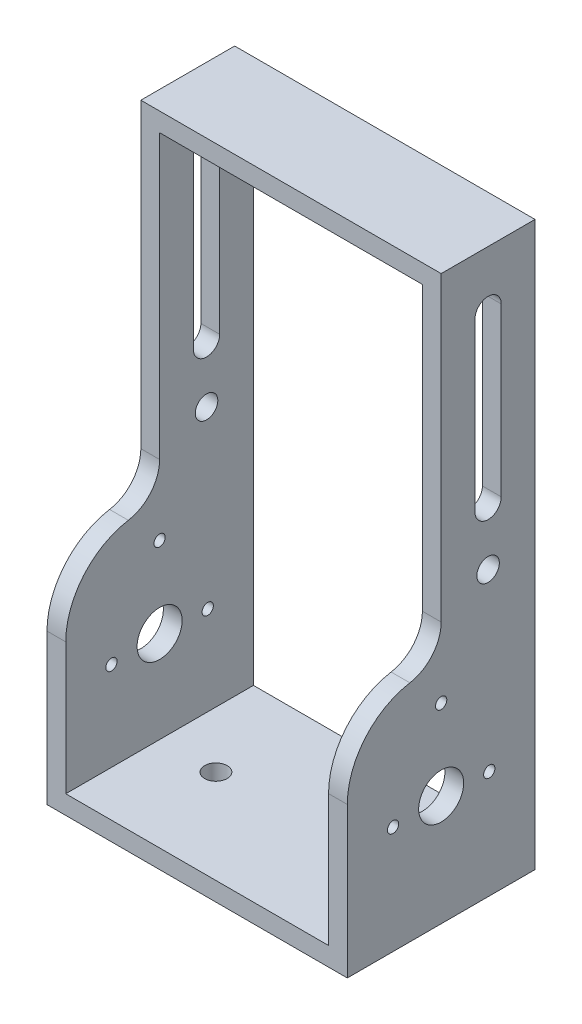
ISO-10303-21;
HEADER;
FILE_DESCRIPTION(('STEP AP214'),'2;1');
FILE_NAME('part.step','',(''),(''),'','','');
FILE_SCHEMA(('AUTOMOTIVE_DESIGN { 1 0 10303 214 1 1 1 1 }'));
ENDSEC;
DATA;
#1=APPLICATION_CONTEXT('core data for automotive mechanical design processes');
#2=APPLICATION_PROTOCOL_DEFINITION('international standard','automotive_design',2000,#1);
#3=PRODUCT_CONTEXT('',#1,'mechanical');
#4=PRODUCT('Part','Part','',(#3));
#5=PRODUCT_RELATED_PRODUCT_CATEGORY('part','',(#4));
#6=PRODUCT_DEFINITION_FORMATION('','',#4);
#7=PRODUCT_DEFINITION_CONTEXT('part definition',#1,'design');
#8=PRODUCT_DEFINITION('design','',#6,#7);
#9=PRODUCT_DEFINITION_SHAPE('','',#8);
#10=(LENGTH_UNIT() NAMED_UNIT(*) SI_UNIT(.MILLI.,.METRE.));
#11=(NAMED_UNIT(*) PLANE_ANGLE_UNIT() SI_UNIT($,.RADIAN.));
#12=(NAMED_UNIT(*) SI_UNIT($,.STERADIAN.) SOLID_ANGLE_UNIT());
#13=UNCERTAINTY_MEASURE_WITH_UNIT(LENGTH_MEASURE(1.E-05),#10,'distance_accuracy_value','');
#14=(GEOMETRIC_REPRESENTATION_CONTEXT(3) GLOBAL_UNCERTAINTY_ASSIGNED_CONTEXT((#13)) GLOBAL_UNIT_ASSIGNED_CONTEXT((#10,
#11,#12)) REPRESENTATION_CONTEXT('',''));
#15=CARTESIAN_POINT('',(0.,0.,0.));
#16=DIRECTION('',(0.,0.,1.));
#17=DIRECTION('',(1.,0.,0.));
#18=AXIS2_PLACEMENT_3D('',#15,#16,#17);
#19=CARTESIAN_POINT('',(0.,0.,25.));
#20=DIRECTION('',(0.,0.,1.));
#21=DIRECTION('',(1.,0.,0.));
#22=AXIS2_PLACEMENT_3D('',#19,#20,#21);
#23=PLANE('',#22);
#24=DIRECTION('',(0.,-1.,0.));
#25=VECTOR('',#24,1.);
#26=CARTESIAN_POINT('',(-35.,70.,25.));
#27=LINE('',#26,#25);
#28=CARTESIAN_POINT('',(-35.,-34.9647322536298,25.));
#29=VERTEX_POINT('',#28);
#30=CARTESIAN_POINT('',(-35.,-70.,25.));
#31=VERTEX_POINT('',#30);
#32=EDGE_CURVE('E281',#29,#31,#27,.T.);
#33=ORIENTED_EDGE('',*,*,#32,.F.);
#34=DIRECTION('',(-1.,0.,0.));
#35=VECTOR('',#34,1.);
#36=CARTESIAN_POINT('',(-40.,-34.9647322536298,25.));
#37=LINE('',#36,#35);
#38=CARTESIAN_POINT('',(-40.,-34.9647322536298,25.));
#39=VERTEX_POINT('',#38);
#40=EDGE_CURVE('E345',#29,#39,#37,.T.);
#41=ORIENTED_EDGE('',*,*,#40,.T.);
#42=DIRECTION('',(0.,-1.,0.));
#43=VECTOR('',#42,1.);
#44=CARTESIAN_POINT('',(-40.,70.,25.));
#45=LINE('',#44,#43);
#46=CARTESIAN_POINT('',(-40.,-75.,25.));
#47=VERTEX_POINT('',#46);
#48=EDGE_CURVE('E310',#39,#47,#45,.T.);
#49=ORIENTED_EDGE('',*,*,#48,.T.);
#50=DIRECTION('',(1.,0.,0.));
#51=VECTOR('',#50,1.);
#52=CARTESIAN_POINT('',(-35.,-75.,25.));
#53=LINE('',#52,#51);
#54=CARTESIAN_POINT('',(40.,-75.,25.));
#55=VERTEX_POINT('',#54);
#56=EDGE_CURVE('E313',#47,#55,#53,.T.);
#57=ORIENTED_EDGE('',*,*,#56,.T.);
#58=DIRECTION('',(0.,1.,0.));
#59=VECTOR('',#58,1.);
#60=CARTESIAN_POINT('',(40.,70.,25.));
#61=LINE('',#60,#59);
#62=CARTESIAN_POINT('',(40.,-34.9647322536298,25.));
#63=VERTEX_POINT('',#62);
#64=EDGE_CURVE('E307',#55,#63,#61,.T.);
#65=ORIENTED_EDGE('',*,*,#64,.T.);
#66=DIRECTION('',(-1.,0.,0.));
#67=VECTOR('',#66,1.);
#68=CARTESIAN_POINT('',(34.9999999999999,-34.9647322536298,25.));
#69=LINE('',#68,#67);
#70=CARTESIAN_POINT('',(35.,-34.9647322536298,25.));
#71=VERTEX_POINT('',#70);
#72=EDGE_CURVE('E343',#63,#71,#69,.T.);
#73=ORIENTED_EDGE('',*,*,#72,.T.);
#74=DIRECTION('',(0.,1.,0.));
#75=VECTOR('',#74,1.);
#76=CARTESIAN_POINT('',(35.,70.,25.));
#77=LINE('',#76,#75);
#78=CARTESIAN_POINT('',(35.,-70.,25.));
#79=VERTEX_POINT('',#78);
#80=EDGE_CURVE('E278',#79,#71,#77,.T.);
#81=ORIENTED_EDGE('',*,*,#80,.F.);
#82=DIRECTION('',(1.,0.,0.));
#83=VECTOR('',#82,1.);
#84=CARTESIAN_POINT('',(-35.,-70.,25.));
#85=LINE('',#84,#83);
#86=EDGE_CURVE('E284',#31,#79,#85,.T.);
#87=ORIENTED_EDGE('',*,*,#86,.F.);
#88=EDGE_LOOP('',(#33,#41,#49,#57,#65,#73,#81,#87));
#89=FACE_BOUND('',#88,.T.);
#90=ADVANCED_FACE('F57',(#89),#23,.T.);
#91=CARTESIAN_POINT('',(0.,0.,-25.));
#92=DIRECTION('',(0.,0.,1.));
#93=DIRECTION('',(1.,0.,0.));
#94=AXIS2_PLACEMENT_3D('',#91,#92,#93);
#95=PLANE('',#94);
#96=DIRECTION('',(0.,1.,0.));
#97=VECTOR('',#96,1.);
#98=CARTESIAN_POINT('',(40.,70.,-25.));
#99=LINE('',#98,#97);
#100=CARTESIAN_POINT('',(40.,-75.,-25.));
#101=VERTEX_POINT('',#100);
#102=CARTESIAN_POINT('',(40.,75.,-25.));
#103=VERTEX_POINT('',#102);
#104=EDGE_CURVE('E306',#101,#103,#99,.T.);
#105=ORIENTED_EDGE('',*,*,#104,.F.);
#106=DIRECTION('',(1.,0.,0.));
#107=VECTOR('',#106,1.);
#108=CARTESIAN_POINT('',(-35.,-75.,-25.));
#109=LINE('',#108,#107);
#110=CARTESIAN_POINT('',(-40.,-75.,-25.));
#111=VERTEX_POINT('',#110);
#112=EDGE_CURVE('E311',#111,#101,#109,.T.);
#113=ORIENTED_EDGE('',*,*,#112,.F.);
#114=DIRECTION('',(0.,-1.,0.));
#115=VECTOR('',#114,1.);
#116=CARTESIAN_POINT('',(-40.,70.,-25.));
#117=LINE('',#116,#115);
#118=CARTESIAN_POINT('',(-40.,75.,-25.));
#119=VERTEX_POINT('',#118);
#120=EDGE_CURVE('E321',#119,#111,#117,.T.);
#121=ORIENTED_EDGE('',*,*,#120,.F.);
#122=DIRECTION('',(-1.,0.,0.));
#123=VECTOR('',#122,1.);
#124=CARTESIAN_POINT('',(-35.,75.,-25.));
#125=LINE('',#124,#123);
#126=EDGE_CURVE('E318',#103,#119,#125,.T.);
#127=ORIENTED_EDGE('',*,*,#126,.F.);
#128=EDGE_LOOP('',(#105,#113,#121,#127));
#129=FACE_BOUND('',#128,.T.);
#130=DIRECTION('',(0.,1.,0.));
#131=VECTOR('',#130,1.);
#132=CARTESIAN_POINT('',(35.,70.,-25.));
#133=LINE('',#132,#131);
#134=CARTESIAN_POINT('',(35.,-70.,-25.));
#135=VERTEX_POINT('',#134);
#136=CARTESIAN_POINT('',(35.,70.,-25.));
#137=VERTEX_POINT('',#136);
#138=EDGE_CURVE('E287',#135,#137,#133,.T.);
#139=ORIENTED_EDGE('',*,*,#138,.T.);
#140=DIRECTION('',(-1.,0.,0.));
#141=VECTOR('',#140,1.);
#142=CARTESIAN_POINT('',(-35.,70.,-25.));
#143=LINE('',#142,#141);
#144=CARTESIAN_POINT('',(-35.,70.,-25.));
#145=VERTEX_POINT('',#144);
#146=EDGE_CURVE('E290',#137,#145,#143,.T.);
#147=ORIENTED_EDGE('',*,*,#146,.T.);
#148=DIRECTION('',(0.,-1.,0.));
#149=VECTOR('',#148,1.);
#150=CARTESIAN_POINT('',(-35.,70.,-25.));
#151=LINE('',#150,#149);
#152=CARTESIAN_POINT('',(-35.,-70.,-25.));
#153=VERTEX_POINT('',#152);
#154=EDGE_CURVE('E293',#145,#153,#151,.T.);
#155=ORIENTED_EDGE('',*,*,#154,.T.);
#156=DIRECTION('',(1.,0.,0.));
#157=VECTOR('',#156,1.);
#158=CARTESIAN_POINT('',(-35.,-70.,-25.));
#159=LINE('',#158,#157);
#160=EDGE_CURVE('E282',#153,#135,#159,.T.);
#161=ORIENTED_EDGE('',*,*,#160,.T.);
#162=EDGE_LOOP('',(#139,#147,#155,#161));
#163=FACE_BOUND('',#162,.T.);
#164=ADVANCED_FACE('F469',(#129,#163),#95,.F.);
#165=CARTESIAN_POINT('',(40.,70.,25.));
#166=DIRECTION('',(-1.,0.,0.));
#167=DIRECTION('',(0.,-1.,0.));
#168=AXIS2_PLACEMENT_3D('',#165,#166,#167);
#169=PLANE('',#168);
#170=DIRECTION('',(0.,-1.,0.));
#171=VECTOR('',#170,1.);
#172=CARTESIAN_POINT('',(40.,60.,-9.00000000000001));
#173=LINE('',#172,#171);
#174=CARTESIAN_POINT('',(40.,60.,-9.00000000000001));
#175=VERTEX_POINT('',#174);
#176=CARTESIAN_POINT('',(40.,15.5,-9.00000000000001));
#177=VERTEX_POINT('',#176);
#178=EDGE_CURVE('E238',#175,#177,#173,.T.);
#179=ORIENTED_EDGE('',*,*,#178,.F.);
#180=CARTESIAN_POINT('',(40.,60.,-12.5));
#181=DIRECTION('',(1.,0.,0.));
#182=DIRECTION('',(0.,1.,0.));
#183=AXIS2_PLACEMENT_3D('',#180,#181,#182);
#184=CIRCLE('',#183,3.5);
#185=CARTESIAN_POINT('',(40.,60.,-16.));
#186=VERTEX_POINT('',#185);
#187=EDGE_CURVE('E61',#186,#175,#184,.T.);
#188=ORIENTED_EDGE('',*,*,#187,.F.);
#189=DIRECTION('',(0.,1.,0.));
#190=VECTOR('',#189,1.);
#191=CARTESIAN_POINT('',(40.,60.,-16.));
#192=LINE('',#191,#190);
#193=CARTESIAN_POINT('',(40.,15.5,-16.));
#194=VERTEX_POINT('',#193);
#195=EDGE_CURVE('E106',#194,#186,#192,.T.);
#196=ORIENTED_EDGE('',*,*,#195,.F.);
#197=CARTESIAN_POINT('',(40.,15.5,-12.5));
#198=DIRECTION('',(1.,0.,0.));
#199=DIRECTION('',(0.,1.,0.));
#200=AXIS2_PLACEMENT_3D('',#197,#198,#199);
#201=CIRCLE('',#200,3.5);
#202=EDGE_CURVE('E242',#177,#194,#201,.T.);
#203=ORIENTED_EDGE('',*,*,#202,.F.);
#204=EDGE_LOOP('',(#179,#188,#196,#203));
#205=FACE_BOUND('',#204,.T.);
#206=CARTESIAN_POINT('',(40.,-46.2711686117605,-12.8178141423564));
#207=DIRECTION('',(-1.,0.,0.));
#208=DIRECTION('',(0.,-1.,0.));
#209=AXIS2_PLACEMENT_3D('',#206,#207,#208);
#210=CIRCLE('',#209,1.49999999999999);
#211=CARTESIAN_POINT('',(40.,-47.7711686117605,-12.8178141423564));
#212=VERTEX_POINT('',#211);
#213=EDGE_CURVE('E388',#212,#212,#210,.T.);
#214=ORIENTED_EDGE('',*,*,#213,.T.);
#215=EDGE_LOOP('',(#214));
#216=FACE_BOUND('',#215,.T.);
#217=CARTESIAN_POINT('',(40.,0.499999999999999,-12.5));
#218=DIRECTION('',(-1.,0.,0.));
#219=DIRECTION('',(0.,-1.,0.));
#220=AXIS2_PLACEMENT_3D('',#217,#218,#219);
#221=CIRCLE('',#220,3.);
#222=CARTESIAN_POINT('',(40.,-2.5,-12.5));
#223=VERTEX_POINT('',#222);
#224=EDGE_CURVE('E373',#223,#223,#221,.T.);
#225=ORIENTED_EDGE('',*,*,#224,.T.);
#226=EDGE_LOOP('',(#225));
#227=FACE_BOUND('',#226,.T.);
#228=CARTESIAN_POINT('',(40.,-45.5237993555332,0.));
#229=DIRECTION('',(-1.,0.,0.));
#230=DIRECTION('',(0.,-1.,0.));
#231=AXIS2_PLACEMENT_3D('',#228,#229,#230);
#232=CIRCLE('',#231,6.);
#233=CARTESIAN_POINT('',(40.,-51.5237993555332,0.));
#234=VERTEX_POINT('',#233);
#235=EDGE_CURVE('E369',#234,#234,#232,.T.);
#236=ORIENTED_EDGE('',*,*,#235,.T.);
#237=EDGE_LOOP('',(#236));
#238=FACE_BOUND('',#237,.T.);
#239=CARTESIAN_POINT('',(40.,-46.2711686117605,12.8178141423564));
#240=DIRECTION('',(-1.,0.,0.));
#241=DIRECTION('',(0.,-1.,0.));
#242=AXIS2_PLACEMENT_3D('',#239,#240,#241);
#243=CIRCLE('',#242,1.49999999999992);
#244=CARTESIAN_POINT('',(40.,-47.7711686117604,12.8178141423564));
#245=VERTEX_POINT('',#244);
#246=EDGE_CURVE('E365',#245,#245,#243,.T.);
#247=ORIENTED_EDGE('',*,*,#246,.T.);
#248=EDGE_LOOP('',(#247));
#249=FACE_BOUND('',#248,.T.);
#250=CARTESIAN_POINT('',(40.,-24.0700632752243,0.));
#251=DIRECTION('',(-1.,0.,0.));
#252=DIRECTION('',(0.,-1.,0.));
#253=AXIS2_PLACEMENT_3D('',#250,#251,#252);
#254=CIRCLE('',#253,1.5);
#255=CARTESIAN_POINT('',(40.,-25.5700632752243,0.));
#256=VERTEX_POINT('',#255);
#257=EDGE_CURVE('E361',#256,#256,#254,.T.);
#258=ORIENTED_EDGE('',*,*,#257,.T.);
#259=EDGE_LOOP('',(#258));
#260=FACE_BOUND('',#259,.T.);
#261=CARTESIAN_POINT('',(40.,-5.38433333813169,10.));
#262=DIRECTION('',(1.,0.,0.));
#263=DIRECTION('',(0.,1.,0.));
#264=AXIS2_PLACEMENT_3D('',#261,#262,#263);
#265=CIRCLE('',#264,10.);
#266=CARTESIAN_POINT('',(40.,-15.2444663099644,8.33333333333333));
#267=VERTEX_POINT('',#266);
#268=CARTESIAN_POINT('',(40.,-5.38433333813165,0.));
#269=VERTEX_POINT('',#268);
#270=EDGE_CURVE('E277',#267,#269,#265,.T.);
#271=ORIENTED_EDGE('',*,*,#270,.F.);
#272=CARTESIAN_POINT('',(40.,-34.9647322536298,5.));
#273=DIRECTION('',(-1.,0.,0.));
#274=DIRECTION('',(0.,-1.,0.));
#275=AXIS2_PLACEMENT_3D('',#272,#273,#274);
#276=CIRCLE('',#275,20.);
#277=EDGE_CURVE('E231',#267,#63,#276,.F.);
#278=ORIENTED_EDGE('',*,*,#277,.T.);
#279=ORIENTED_EDGE('',*,*,#64,.F.);
#280=DIRECTION('',(0.,0.,-1.));
#281=VECTOR('',#280,1.);
#282=CARTESIAN_POINT('',(40.,-75.,25.));
#283=LINE('',#282,#281);
#284=EDGE_CURVE('E315',#55,#101,#283,.T.);
#285=ORIENTED_EDGE('',*,*,#284,.T.);
#286=ORIENTED_EDGE('',*,*,#104,.T.);
#287=DIRECTION('',(0.,0.,-1.));
#288=VECTOR('',#287,1.);
#289=CARTESIAN_POINT('',(40.,75.,25.));
#290=LINE('',#289,#288);
#291=CARTESIAN_POINT('',(40.,75.,0.));
#292=VERTEX_POINT('',#291);
#293=EDGE_CURVE('E331',#292,#103,#290,.T.);
#294=ORIENTED_EDGE('',*,*,#293,.F.);
#295=DIRECTION('',(0.,-1.,0.));
#296=VECTOR('',#295,1.);
#297=CARTESIAN_POINT('',(40.,70.,0.));
#298=LINE('',#297,#296);
#299=EDGE_CURVE('E271',#292,#269,#298,.T.);
#300=ORIENTED_EDGE('',*,*,#299,.T.);
#301=EDGE_LOOP('',(#271,#278,#279,#285,#286,#294,#300));
#302=FACE_BOUND('',#301,.T.);
#303=ADVANCED_FACE('F444',(#205,#216,#227,#238,#249,#260,#302),#169,.F.);
#304=CARTESIAN_POINT('',(-35.,75.,25.));
#305=DIRECTION('',(0.,-1.,0.));
#306=DIRECTION('',(0.,0.,-1.));
#307=AXIS2_PLACEMENT_3D('',#304,#305,#306);
#308=PLANE('',#307);
#309=DIRECTION('',(0.,0.,-1.));
#310=VECTOR('',#309,1.);
#311=CARTESIAN_POINT('',(-40.,75.,25.));
#312=LINE('',#311,#310);
#313=CARTESIAN_POINT('',(-40.,75.,0.));
#314=VERTEX_POINT('',#313);
#315=EDGE_CURVE('E329',#314,#119,#312,.T.);
#316=ORIENTED_EDGE('',*,*,#315,.F.);
#317=DIRECTION('',(1.,0.,0.));
#318=VECTOR('',#317,1.);
#319=CARTESIAN_POINT('',(-40.,75.,0.));
#320=LINE('',#319,#318);
#321=EDGE_CURVE('E258',#314,#292,#320,.T.);
#322=ORIENTED_EDGE('',*,*,#321,.T.);
#323=ORIENTED_EDGE('',*,*,#293,.T.);
#324=ORIENTED_EDGE('',*,*,#126,.T.);
#325=EDGE_LOOP('',(#316,#322,#323,#324));
#326=FACE_BOUND('',#325,.T.);
#327=ADVANCED_FACE('F488',(#326),#308,.F.);
#328=CARTESIAN_POINT('',(-40.,70.,25.));
#329=DIRECTION('',(1.,0.,0.));
#330=DIRECTION('',(0.,1.,0.));
#331=AXIS2_PLACEMENT_3D('',#328,#329,#330);
#332=PLANE('',#331);
#333=DIRECTION('',(0.,1.,0.));
#334=VECTOR('',#333,1.);
#335=CARTESIAN_POINT('',(-40.0000000000001,60.,-16.));
#336=LINE('',#335,#334);
#337=CARTESIAN_POINT('',(-40.0000000000001,15.5,-16.));
#338=VERTEX_POINT('',#337);
#339=CARTESIAN_POINT('',(-40.0000000000001,60.,-16.));
#340=VERTEX_POINT('',#339);
#341=EDGE_CURVE('E402',#338,#340,#336,.T.);
#342=ORIENTED_EDGE('',*,*,#341,.T.);
#343=CARTESIAN_POINT('',(-40.0000000000001,60.,-12.5));
#344=DIRECTION('',(1.,0.,0.));
#345=DIRECTION('',(0.,1.,0.));
#346=AXIS2_PLACEMENT_3D('',#343,#344,#345);
#347=CIRCLE('',#346,3.5);
#348=CARTESIAN_POINT('',(-40.0000000000001,60.,-9.00000000000001));
#349=VERTEX_POINT('',#348);
#350=EDGE_CURVE('E433',#340,#349,#347,.T.);
#351=ORIENTED_EDGE('',*,*,#350,.T.);
#352=DIRECTION('',(0.,-1.,0.));
#353=VECTOR('',#352,1.);
#354=CARTESIAN_POINT('',(-40.0000000000001,60.,-9.00000000000001));
#355=LINE('',#354,#353);
#356=CARTESIAN_POINT('',(-40.,15.5,-9.00000000000001));
#357=VERTEX_POINT('',#356);
#358=EDGE_CURVE('E210',#349,#357,#355,.T.);
#359=ORIENTED_EDGE('',*,*,#358,.T.);
#360=CARTESIAN_POINT('',(-40.0000000000001,15.5,-12.5));
#361=DIRECTION('',(1.,0.,0.));
#362=DIRECTION('',(0.,1.,0.));
#363=AXIS2_PLACEMENT_3D('',#360,#361,#362);
#364=CIRCLE('',#363,3.5);
#365=EDGE_CURVE('E83',#357,#338,#364,.T.);
#366=ORIENTED_EDGE('',*,*,#365,.T.);
#367=EDGE_LOOP('',(#342,#351,#359,#366));
#368=FACE_BOUND('',#367,.T.);
#369=CARTESIAN_POINT('',(-40.0000000000001,-46.2711686117605,-12.8178141423564));
#370=DIRECTION('',(1.,0.,0.));
#371=DIRECTION('',(0.,1.,0.));
#372=AXIS2_PLACEMENT_3D('',#369,#370,#371);
#373=CIRCLE('',#372,1.49999999999999);
#374=CARTESIAN_POINT('',(-40.0000000000001,-44.7711686117605,-12.8178141423564));
#375=VERTEX_POINT('',#374);
#376=EDGE_CURVE('E419',#375,#375,#373,.T.);
#377=ORIENTED_EDGE('',*,*,#376,.T.);
#378=EDGE_LOOP('',(#377));
#379=FACE_BOUND('',#378,.T.);
#380=CARTESIAN_POINT('',(-40.0000000000001,0.499999999999988,-12.5));
#381=DIRECTION('',(1.,0.,0.));
#382=DIRECTION('',(0.,1.,0.));
#383=AXIS2_PLACEMENT_3D('',#380,#381,#382);
#384=CIRCLE('',#383,3.);
#385=CARTESIAN_POINT('',(-40.0000000000001,3.49999999999999,-12.5));
#386=VERTEX_POINT('',#385);
#387=EDGE_CURVE('E430',#386,#386,#384,.T.);
#388=ORIENTED_EDGE('',*,*,#387,.T.);
#389=EDGE_LOOP('',(#388));
#390=FACE_BOUND('',#389,.T.);
#391=CARTESIAN_POINT('',(-40.0000000000001,-45.5237993555332,0.));
#392=DIRECTION('',(1.,0.,0.));
#393=DIRECTION('',(0.,1.,0.));
#394=AXIS2_PLACEMENT_3D('',#391,#392,#393);
#395=CIRCLE('',#394,6.);
#396=CARTESIAN_POINT('',(-40.0000000000001,-39.5237993555332,0.));
#397=VERTEX_POINT('',#396);
#398=EDGE_CURVE('E427',#397,#397,#395,.T.);
#399=ORIENTED_EDGE('',*,*,#398,.T.);
#400=EDGE_LOOP('',(#399));
#401=FACE_BOUND('',#400,.T.);
#402=CARTESIAN_POINT('',(-40.0000000000001,-46.2711686117605,12.8178141423564));
#403=DIRECTION('',(1.,0.,0.));
#404=DIRECTION('',(0.,1.,0.));
#405=AXIS2_PLACEMENT_3D('',#402,#403,#404);
#406=CIRCLE('',#405,1.49999999999992);
#407=CARTESIAN_POINT('',(-40.0000000000001,-44.7711686117606,12.8178141423564));
#408=VERTEX_POINT('',#407);
#409=EDGE_CURVE('E424',#408,#408,#406,.T.);
#410=ORIENTED_EDGE('',*,*,#409,.T.);
#411=EDGE_LOOP('',(#410));
#412=FACE_BOUND('',#411,.T.);
#413=CARTESIAN_POINT('',(-40.0000000000001,-24.0700632752243,0.));
#414=DIRECTION('',(1.,0.,0.));
#415=DIRECTION('',(0.,1.,0.));
#416=AXIS2_PLACEMENT_3D('',#413,#414,#415);
#417=CIRCLE('',#416,1.5);
#418=CARTESIAN_POINT('',(-40.0000000000001,-22.5700632752243,0.));
#419=VERTEX_POINT('',#418);
#420=EDGE_CURVE('E422',#419,#419,#417,.T.);
#421=ORIENTED_EDGE('',*,*,#420,.T.);
#422=EDGE_LOOP('',(#421));
#423=FACE_BOUND('',#422,.T.);
#424=ORIENTED_EDGE('',*,*,#48,.F.);
#425=CARTESIAN_POINT('',(-40.,-34.9647322536298,5.));
#426=DIRECTION('',(1.,0.,0.));
#427=DIRECTION('',(0.,1.,0.));
#428=AXIS2_PLACEMENT_3D('',#425,#426,#427);
#429=CIRCLE('',#428,20.);
#430=CARTESIAN_POINT('',(-40.,-15.2444663099644,8.33333333333333));
#431=VERTEX_POINT('',#430);
#432=EDGE_CURVE('E347',#39,#431,#429,.F.);
#433=ORIENTED_EDGE('',*,*,#432,.T.);
#434=CARTESIAN_POINT('',(-40.,-5.3843333381317,10.));
#435=DIRECTION('',(1.,0.,0.));
#436=DIRECTION('',(0.,1.,0.));
#437=AXIS2_PLACEMENT_3D('',#434,#435,#436);
#438=CIRCLE('',#437,10.);
#439=CARTESIAN_POINT('',(-40.,-5.38433333813162,0.));
#440=VERTEX_POINT('',#439);
#441=EDGE_CURVE('E252',#431,#440,#438,.T.);
#442=ORIENTED_EDGE('',*,*,#441,.T.);
#443=DIRECTION('',(0.,1.,0.));
#444=VECTOR('',#443,1.);
#445=CARTESIAN_POINT('',(-40.,-5.38433333813162,0.));
#446=LINE('',#445,#444);
#447=EDGE_CURVE('E254',#440,#314,#446,.T.);
#448=ORIENTED_EDGE('',*,*,#447,.T.);
#449=ORIENTED_EDGE('',*,*,#315,.T.);
#450=ORIENTED_EDGE('',*,*,#120,.T.);
#451=DIRECTION('',(0.,0.,-1.));
#452=VECTOR('',#451,1.);
#453=CARTESIAN_POINT('',(-40.,-75.,25.));
#454=LINE('',#453,#452);
#455=EDGE_CURVE('E326',#47,#111,#454,.T.);
#456=ORIENTED_EDGE('',*,*,#455,.F.);
#457=EDGE_LOOP('',(#424,#433,#442,#448,#449,#450,#456));
#458=FACE_BOUND('',#457,.T.);
#459=ADVANCED_FACE('F484',(#368,#379,#390,#401,#412,#423,#458),#332,.F.);
#460=CARTESIAN_POINT('',(-35.,-75.,25.));
#461=DIRECTION('',(0.,1.,0.));
#462=DIRECTION('',(0.,0.,1.));
#463=AXIS2_PLACEMENT_3D('',#460,#461,#462);
#464=PLANE('',#463);
#465=CARTESIAN_POINT('',(20.,-75.,0.));
#466=DIRECTION('',(0.,1.,0.));
#467=DIRECTION('',(0.,0.,1.));
#468=AXIS2_PLACEMENT_3D('',#465,#466,#467);
#469=CIRCLE('',#468,3.);
#470=CARTESIAN_POINT('',(20.,-75.,3.));
#471=VERTEX_POINT('',#470);
#472=EDGE_CURVE('E575',#471,#471,#469,.T.);
#473=ORIENTED_EDGE('',*,*,#472,.T.);
#474=EDGE_LOOP('',(#473));
#475=FACE_BOUND('',#474,.T.);
#476=CARTESIAN_POINT('',(-20.,-75.,0.));
#477=DIRECTION('',(0.,1.,0.));
#478=DIRECTION('',(0.,0.,1.));
#479=AXIS2_PLACEMENT_3D('',#476,#477,#478);
#480=CIRCLE('',#479,3.);
#481=CARTESIAN_POINT('',(-20.,-75.,3.));
#482=VERTEX_POINT('',#481);
#483=EDGE_CURVE('E580',#482,#482,#480,.T.);
#484=ORIENTED_EDGE('',*,*,#483,.T.);
#485=EDGE_LOOP('',(#484));
#486=FACE_BOUND('',#485,.T.);
#487=ORIENTED_EDGE('',*,*,#112,.T.);
#488=ORIENTED_EDGE('',*,*,#284,.F.);
#489=ORIENTED_EDGE('',*,*,#56,.F.);
#490=ORIENTED_EDGE('',*,*,#455,.T.);
#491=EDGE_LOOP('',(#487,#488,#489,#490));
#492=FACE_BOUND('',#491,.T.);
#493=ADVANCED_FACE('F481',(#475,#486,#492),#464,.F.);
#494=CARTESIAN_POINT('',(35.,70.,25.));
#495=DIRECTION('',(-1.,0.,0.));
#496=DIRECTION('',(0.,-1.,0.));
#497=AXIS2_PLACEMENT_3D('',#494,#495,#496);
#498=PLANE('',#497);
#499=CARTESIAN_POINT('',(35.,60.,-12.5));
#500=DIRECTION('',(-1.,0.,0.));
#501=DIRECTION('',(0.,-1.,0.));
#502=AXIS2_PLACEMENT_3D('',#499,#500,#501);
#503=CIRCLE('',#502,3.5);
#504=CARTESIAN_POINT('',(35.,60.,-9.00000000000001));
#505=VERTEX_POINT('',#504);
#506=CARTESIAN_POINT('',(35.,60.,-16.));
#507=VERTEX_POINT('',#506);
#508=EDGE_CURVE('E115',#505,#507,#503,.T.);
#509=ORIENTED_EDGE('',*,*,#508,.F.);
#510=DIRECTION('',(0.,1.,0.));
#511=VECTOR('',#510,1.);
#512=CARTESIAN_POINT('',(35.,70.,-9.));
#513=LINE('',#512,#511);
#514=CARTESIAN_POINT('',(35.,15.5,-9.00000000000001));
#515=VERTEX_POINT('',#514);
#516=EDGE_CURVE('E241',#515,#505,#513,.T.);
#517=ORIENTED_EDGE('',*,*,#516,.F.);
#518=CARTESIAN_POINT('',(35.,15.5,-12.5));
#519=DIRECTION('',(-1.,0.,0.));
#520=DIRECTION('',(0.,-1.,0.));
#521=AXIS2_PLACEMENT_3D('',#518,#519,#520);
#522=CIRCLE('',#521,3.5);
#523=CARTESIAN_POINT('',(35.,15.5,-16.));
#524=VERTEX_POINT('',#523);
#525=EDGE_CURVE('E240',#524,#515,#522,.T.);
#526=ORIENTED_EDGE('',*,*,#525,.F.);
#527=DIRECTION('',(0.,-1.,0.));
#528=VECTOR('',#527,1.);
#529=CARTESIAN_POINT('',(35.,70.,-16.));
#530=LINE('',#529,#528);
#531=EDGE_CURVE('E243',#507,#524,#530,.T.);
#532=ORIENTED_EDGE('',*,*,#531,.F.);
#533=EDGE_LOOP('',(#509,#517,#526,#532));
#534=FACE_BOUND('',#533,.T.);
#535=CARTESIAN_POINT('',(35.,-46.2711686117605,-12.8178141423564));
#536=DIRECTION('',(-1.,0.,0.));
#537=DIRECTION('',(0.,-1.,0.));
#538=AXIS2_PLACEMENT_3D('',#535,#536,#537);
#539=CIRCLE('',#538,1.49999999999999);
#540=CARTESIAN_POINT('',(35.,-47.7711686117605,-12.8178141423564));
#541=VERTEX_POINT('',#540);
#542=EDGE_CURVE('E385',#541,#541,#539,.T.);
#543=ORIENTED_EDGE('',*,*,#542,.F.);
#544=EDGE_LOOP('',(#543));
#545=FACE_BOUND('',#544,.T.);
#546=CARTESIAN_POINT('',(35.,0.499999999999999,-12.5));
#547=DIRECTION('',(-1.,0.,0.));
#548=DIRECTION('',(0.,-1.,0.));
#549=AXIS2_PLACEMENT_3D('',#546,#547,#548);
#550=CIRCLE('',#549,3.);
#551=CARTESIAN_POINT('',(35.,-2.5,-12.5));
#552=VERTEX_POINT('',#551);
#553=EDGE_CURVE('E368',#552,#552,#550,.T.);
#554=ORIENTED_EDGE('',*,*,#553,.F.);
#555=EDGE_LOOP('',(#554));
#556=FACE_BOUND('',#555,.T.);
#557=CARTESIAN_POINT('',(35.,-45.5237993555332,0.));
#558=DIRECTION('',(-1.,0.,0.));
#559=DIRECTION('',(0.,-1.,0.));
#560=AXIS2_PLACEMENT_3D('',#557,#558,#559);
#561=CIRCLE('',#560,6.);
#562=CARTESIAN_POINT('',(35.,-51.5237993555332,0.));
#563=VERTEX_POINT('',#562);
#564=EDGE_CURVE('E364',#563,#563,#561,.T.);
#565=ORIENTED_EDGE('',*,*,#564,.F.);
#566=EDGE_LOOP('',(#565));
#567=FACE_BOUND('',#566,.T.);
#568=CARTESIAN_POINT('',(35.,-46.2711686117605,12.8178141423564));
#569=DIRECTION('',(-1.,0.,0.));
#570=DIRECTION('',(0.,-1.,0.));
#571=AXIS2_PLACEMENT_3D('',#568,#569,#570);
#572=CIRCLE('',#571,1.49999999999992);
#573=CARTESIAN_POINT('',(35.,-47.7711686117604,12.8178141423564));
#574=VERTEX_POINT('',#573);
#575=EDGE_CURVE('E360',#574,#574,#572,.T.);
#576=ORIENTED_EDGE('',*,*,#575,.F.);
#577=EDGE_LOOP('',(#576));
#578=FACE_BOUND('',#577,.T.);
#579=CARTESIAN_POINT('',(35.,-24.0700632752243,0.));
#580=DIRECTION('',(-1.,0.,0.));
#581=DIRECTION('',(0.,-1.,0.));
#582=AXIS2_PLACEMENT_3D('',#579,#580,#581);
#583=CIRCLE('',#582,1.5);
#584=CARTESIAN_POINT('',(35.,-25.5700632752243,0.));
#585=VERTEX_POINT('',#584);
#586=EDGE_CURVE('E356',#585,#585,#583,.T.);
#587=ORIENTED_EDGE('',*,*,#586,.F.);
#588=EDGE_LOOP('',(#587));
#589=FACE_BOUND('',#588,.T.);
#590=ORIENTED_EDGE('',*,*,#80,.T.);
#591=CARTESIAN_POINT('',(35.,-34.9647322536298,5.));
#592=DIRECTION('',(-1.,0.,0.));
#593=DIRECTION('',(0.,-1.,0.));
#594=AXIS2_PLACEMENT_3D('',#591,#592,#593);
#595=CIRCLE('',#594,20.);
#596=CARTESIAN_POINT('',(35.,-15.2444663099644,8.33333333333333));
#597=VERTEX_POINT('',#596);
#598=EDGE_CURVE('E228',#71,#597,#595,.T.);
#599=ORIENTED_EDGE('',*,*,#598,.T.);
#600=CARTESIAN_POINT('',(35.,-5.38433333813169,10.));
#601=DIRECTION('',(-1.,0.,0.));
#602=DIRECTION('',(0.,-1.,0.));
#603=AXIS2_PLACEMENT_3D('',#600,#601,#602);
#604=CIRCLE('',#603,10.);
#605=CARTESIAN_POINT('',(35.,-5.38433333813161,0.));
#606=VERTEX_POINT('',#605);
#607=EDGE_CURVE('E274',#606,#597,#604,.T.);
#608=ORIENTED_EDGE('',*,*,#607,.F.);
#609=DIRECTION('',(0.,-1.,0.));
#610=VECTOR('',#609,1.);
#611=CARTESIAN_POINT('',(35.,70.,0.));
#612=LINE('',#611,#610);
#613=CARTESIAN_POINT('',(35.,70.,0.));
#614=VERTEX_POINT('',#613);
#615=EDGE_CURVE('E269',#614,#606,#612,.T.);
#616=ORIENTED_EDGE('',*,*,#615,.F.);
#617=DIRECTION('',(0.,0.,-1.));
#618=VECTOR('',#617,1.);
#619=CARTESIAN_POINT('',(35.,70.,25.));
#620=LINE('',#619,#618);
#621=EDGE_CURVE('E304',#614,#137,#620,.T.);
#622=ORIENTED_EDGE('',*,*,#621,.T.);
#623=ORIENTED_EDGE('',*,*,#138,.F.);
#624=DIRECTION('',(0.,0.,-1.));
#625=VECTOR('',#624,1.);
#626=CARTESIAN_POINT('',(35.,-70.,25.));
#627=LINE('',#626,#625);
#628=EDGE_CURVE('E286',#79,#135,#627,.T.);
#629=ORIENTED_EDGE('',*,*,#628,.F.);
#630=EDGE_LOOP('',(#590,#599,#608,#616,#622,#623,#629));
#631=FACE_BOUND('',#630,.T.);
#632=ADVANCED_FACE('F403',(#534,#545,#556,#567,#578,#589,#631),#498,.T.);
#633=CARTESIAN_POINT('',(-35.,70.,25.));
#634=DIRECTION('',(0.,-1.,0.));
#635=DIRECTION('',(0.,0.,-1.));
#636=AXIS2_PLACEMENT_3D('',#633,#634,#635);
#637=PLANE('',#636);
#638=CARTESIAN_POINT('',(0.,70.,-12.5));
#639=DIRECTION('',(0.,-1.,0.));
#640=DIRECTION('',(0.,0.,-1.));
#641=AXIS2_PLACEMENT_3D('',#638,#639,#640);
#642=CIRCLE('',#641,1.5);
#643=CARTESIAN_POINT('',(0.,70.,-14.));
#644=VERTEX_POINT('',#643);
#645=EDGE_CURVE('E573',#644,#644,#642,.T.);
#646=ORIENTED_EDGE('',*,*,#645,.F.);
#647=EDGE_LOOP('',(#646));
#648=FACE_BOUND('',#647,.T.);
#649=DIRECTION('',(1.,0.,0.));
#650=VECTOR('',#649,1.);
#651=CARTESIAN_POINT('',(-35.,70.,0.));
#652=LINE('',#651,#650);
#653=CARTESIAN_POINT('',(-35.,70.,0.));
#654=VERTEX_POINT('',#653);
#655=EDGE_CURVE('E261',#654,#614,#652,.T.);
#656=ORIENTED_EDGE('',*,*,#655,.F.);
#657=DIRECTION('',(0.,0.,-1.));
#658=VECTOR('',#657,1.);
#659=CARTESIAN_POINT('',(-35.,70.,25.));
#660=LINE('',#659,#658);
#661=EDGE_CURVE('E302',#654,#145,#660,.T.);
#662=ORIENTED_EDGE('',*,*,#661,.T.);
#663=ORIENTED_EDGE('',*,*,#146,.F.);
#664=ORIENTED_EDGE('',*,*,#621,.F.);
#665=EDGE_LOOP('',(#656,#662,#663,#664));
#666=FACE_BOUND('',#665,.T.);
#667=ADVANCED_FACE('F545',(#648,#666),#637,.T.);
#668=CARTESIAN_POINT('',(-35.,70.,25.));
#669=DIRECTION('',(1.,0.,0.));
#670=DIRECTION('',(0.,1.,0.));
#671=AXIS2_PLACEMENT_3D('',#668,#669,#670);
#672=PLANE('',#671);
#673=CARTESIAN_POINT('',(-35.,60.,-12.5));
#674=DIRECTION('',(1.,0.,0.));
#675=DIRECTION('',(0.,1.,0.));
#676=AXIS2_PLACEMENT_3D('',#673,#674,#675);
#677=CIRCLE('',#676,3.5);
#678=CARTESIAN_POINT('',(-35.,60.,-16.));
#679=VERTEX_POINT('',#678);
#680=CARTESIAN_POINT('',(-35.,60.,-9.));
#681=VERTEX_POINT('',#680);
#682=EDGE_CURVE('E12',#679,#681,#677,.T.);
#683=ORIENTED_EDGE('',*,*,#682,.F.);
#684=DIRECTION('',(0.,1.,0.));
#685=VECTOR('',#684,1.);
#686=CARTESIAN_POINT('',(-35.,70.,-16.));
#687=LINE('',#686,#685);
#688=CARTESIAN_POINT('',(-35.,15.5,-16.));
#689=VERTEX_POINT('',#688);
#690=EDGE_CURVE('E66',#689,#679,#687,.T.);
#691=ORIENTED_EDGE('',*,*,#690,.F.);
#692=CARTESIAN_POINT('',(-35.,15.5,-12.5));
#693=DIRECTION('',(1.,0.,0.));
#694=DIRECTION('',(0.,1.,0.));
#695=AXIS2_PLACEMENT_3D('',#692,#693,#694);
#696=CIRCLE('',#695,3.5);
#697=CARTESIAN_POINT('',(-35.,15.5,-9.00000000000001));
#698=VERTEX_POINT('',#697);
#699=EDGE_CURVE('E227',#698,#689,#696,.T.);
#700=ORIENTED_EDGE('',*,*,#699,.F.);
#701=DIRECTION('',(0.,-1.,0.));
#702=VECTOR('',#701,1.);
#703=CARTESIAN_POINT('',(-35.,70.,-9.));
#704=LINE('',#703,#702);
#705=EDGE_CURVE('E207',#681,#698,#704,.T.);
#706=ORIENTED_EDGE('',*,*,#705,.F.);
#707=EDGE_LOOP('',(#683,#691,#700,#706));
#708=FACE_BOUND('',#707,.T.);
#709=CARTESIAN_POINT('',(-35.,-46.2711686117605,-12.8178141423564));
#710=DIRECTION('',(1.,0.,0.));
#711=DIRECTION('',(0.,1.,0.));
#712=AXIS2_PLACEMENT_3D('',#709,#710,#711);
#713=CIRCLE('',#712,1.49999999999999);
#714=CARTESIAN_POINT('',(-35.,-44.7711686117605,-12.8178141423564));
#715=VERTEX_POINT('',#714);
#716=EDGE_CURVE('E234',#715,#715,#713,.T.);
#717=ORIENTED_EDGE('',*,*,#716,.F.);
#718=EDGE_LOOP('',(#717));
#719=FACE_BOUND('',#718,.T.);
#720=CARTESIAN_POINT('',(-35.,0.499999999999989,-12.5));
#721=DIRECTION('',(1.,0.,0.));
#722=DIRECTION('',(0.,1.,0.));
#723=AXIS2_PLACEMENT_3D('',#720,#721,#722);
#724=CIRCLE('',#723,3.);
#725=CARTESIAN_POINT('',(-35.,3.49999999999999,-12.5));
#726=VERTEX_POINT('',#725);
#727=EDGE_CURVE('E366',#726,#726,#724,.T.);
#728=ORIENTED_EDGE('',*,*,#727,.F.);
#729=EDGE_LOOP('',(#728));
#730=FACE_BOUND('',#729,.T.);
#731=CARTESIAN_POINT('',(-35.,-45.5237993555332,0.));
#732=DIRECTION('',(1.,0.,0.));
#733=DIRECTION('',(0.,1.,0.));
#734=AXIS2_PLACEMENT_3D('',#731,#732,#733);
#735=CIRCLE('',#734,6.);
#736=CARTESIAN_POINT('',(-35.,-39.5237993555332,0.));
#737=VERTEX_POINT('',#736);
#738=EDGE_CURVE('E362',#737,#737,#735,.T.);
#739=ORIENTED_EDGE('',*,*,#738,.F.);
#740=EDGE_LOOP('',(#739));
#741=FACE_BOUND('',#740,.T.);
#742=CARTESIAN_POINT('',(-35.,-46.2711686117605,12.8178141423564));
#743=DIRECTION('',(1.,0.,0.));
#744=DIRECTION('',(0.,1.,0.));
#745=AXIS2_PLACEMENT_3D('',#742,#743,#744);
#746=CIRCLE('',#745,1.49999999999992);
#747=CARTESIAN_POINT('',(-35.,-44.7711686117606,12.8178141423564));
#748=VERTEX_POINT('',#747);
#749=EDGE_CURVE('E357',#748,#748,#746,.T.);
#750=ORIENTED_EDGE('',*,*,#749,.F.);
#751=EDGE_LOOP('',(#750));
#752=FACE_BOUND('',#751,.T.);
#753=CARTESIAN_POINT('',(-35.,-24.0700632752243,0.));
#754=DIRECTION('',(1.,0.,0.));
#755=DIRECTION('',(0.,1.,0.));
#756=AXIS2_PLACEMENT_3D('',#753,#754,#755);
#757=CIRCLE('',#756,1.5);
#758=CARTESIAN_POINT('',(-35.,-22.5700632752243,0.));
#759=VERTEX_POINT('',#758);
#760=EDGE_CURVE('E353',#759,#759,#757,.T.);
#761=ORIENTED_EDGE('',*,*,#760,.F.);
#762=EDGE_LOOP('',(#761));
#763=FACE_BOUND('',#762,.T.);
#764=CARTESIAN_POINT('',(-35.,-5.3843333381317,10.));
#765=DIRECTION('',(1.,0.,0.));
#766=DIRECTION('',(0.,1.,0.));
#767=AXIS2_PLACEMENT_3D('',#764,#765,#766);
#768=CIRCLE('',#767,10.);
#769=CARTESIAN_POINT('',(-35.,-15.2444663099644,8.33333333333333));
#770=VERTEX_POINT('',#769);
#771=CARTESIAN_POINT('',(-35.,-5.38433333813162,0.));
#772=VERTEX_POINT('',#771);
#773=EDGE_CURVE('E335',#770,#772,#768,.T.);
#774=ORIENTED_EDGE('',*,*,#773,.F.);
#775=CARTESIAN_POINT('',(-35.,-34.9647322536298,5.));
#776=DIRECTION('',(1.,0.,0.));
#777=DIRECTION('',(0.,1.,0.));
#778=AXIS2_PLACEMENT_3D('',#775,#776,#777);
#779=CIRCLE('',#778,20.);
#780=EDGE_CURVE('E341',#770,#29,#779,.T.);
#781=ORIENTED_EDGE('',*,*,#780,.T.);
#782=ORIENTED_EDGE('',*,*,#32,.T.);
#783=DIRECTION('',(0.,0.,-1.));
#784=VECTOR('',#783,1.);
#785=CARTESIAN_POINT('',(-35.,-70.,25.));
#786=LINE('',#785,#784);
#787=EDGE_CURVE('E300',#31,#153,#786,.T.);
#788=ORIENTED_EDGE('',*,*,#787,.T.);
#789=ORIENTED_EDGE('',*,*,#154,.F.);
#790=ORIENTED_EDGE('',*,*,#661,.F.);
#791=DIRECTION('',(0.,1.,0.));
#792=VECTOR('',#791,1.);
#793=CARTESIAN_POINT('',(-35.,70.,0.));
#794=LINE('',#793,#792);
#795=EDGE_CURVE('E333',#772,#654,#794,.T.);
#796=ORIENTED_EDGE('',*,*,#795,.F.);
#797=EDGE_LOOP('',(#774,#781,#782,#788,#789,#790,#796));
#798=FACE_BOUND('',#797,.T.);
#799=ADVANCED_FACE('F224',(#708,#719,#730,#741,#752,#763,#798),#672,.T.);
#800=CARTESIAN_POINT('',(-35.,-70.,25.));
#801=DIRECTION('',(0.,1.,0.));
#802=DIRECTION('',(0.,0.,1.));
#803=AXIS2_PLACEMENT_3D('',#800,#801,#802);
#804=PLANE('',#803);
#805=CARTESIAN_POINT('',(20.,-70.,0.));
#806=DIRECTION('',(0.,1.,0.));
#807=DIRECTION('',(0.,0.,1.));
#808=AXIS2_PLACEMENT_3D('',#805,#806,#807);
#809=CIRCLE('',#808,3.);
#810=CARTESIAN_POINT('',(20.,-70.,3.));
#811=VERTEX_POINT('',#810);
#812=EDGE_CURVE('E637',#811,#811,#809,.T.);
#813=ORIENTED_EDGE('',*,*,#812,.F.);
#814=EDGE_LOOP('',(#813));
#815=FACE_BOUND('',#814,.T.);
#816=CARTESIAN_POINT('',(-20.,-70.,0.));
#817=DIRECTION('',(0.,1.,0.));
#818=DIRECTION('',(0.,0.,-1.));
#819=AXIS2_PLACEMENT_3D('',#816,#817,#818);
#820=CIRCLE('',#819,3.);
#821=CARTESIAN_POINT('',(-20.,-70.,-3.));
#822=VERTEX_POINT('',#821);
#823=EDGE_CURVE('E644',#822,#822,#820,.T.);
#824=ORIENTED_EDGE('',*,*,#823,.F.);
#825=EDGE_LOOP('',(#824));
#826=FACE_BOUND('',#825,.T.);
#827=ORIENTED_EDGE('',*,*,#160,.F.);
#828=ORIENTED_EDGE('',*,*,#787,.F.);
#829=ORIENTED_EDGE('',*,*,#86,.T.);
#830=ORIENTED_EDGE('',*,*,#628,.T.);
#831=EDGE_LOOP('',(#827,#828,#829,#830));
#832=FACE_BOUND('',#831,.T.);
#833=ADVANCED_FACE('F539',(#815,#826,#832),#804,.T.);
#834=CARTESIAN_POINT('',(-40.,-5.3843333381317,10.));
#835=DIRECTION('',(1.,0.,0.));
#836=DIRECTION('',(0.,1.,0.));
#837=AXIS2_PLACEMENT_3D('',#834,#835,#836);
#838=CYLINDRICAL_SURFACE('',#837,10.);
#839=ORIENTED_EDGE('',*,*,#607,.T.);
#840=DIRECTION('',(1.,0.,0.));
#841=VECTOR('',#840,1.);
#842=CARTESIAN_POINT('',(-40.,-15.2444663099644,8.33333333333333));
#843=LINE('',#842,#841);
#844=EDGE_CURVE('E349',#597,#267,#843,.T.);
#845=ORIENTED_EDGE('',*,*,#844,.T.);
#846=ORIENTED_EDGE('',*,*,#270,.T.);
#847=DIRECTION('',(1.,0.,0.));
#848=VECTOR('',#847,1.);
#849=CARTESIAN_POINT('',(-40.,-5.38433333813162,0.));
#850=LINE('',#849,#848);
#851=EDGE_CURVE('E257',#606,#269,#850,.T.);
#852=ORIENTED_EDGE('',*,*,#851,.F.);
#853=EDGE_LOOP('',(#839,#845,#846,#852));
#854=FACE_BOUND('',#853,.T.);
#855=ADVANCED_FACE('F507',(#854),#838,.F.);
#856=CARTESIAN_POINT('',(-40.,-5.38433333813162,0.));
#857=DIRECTION('',(0.,0.,-1.));
#858=DIRECTION('',(-1.,0.,0.));
#859=AXIS2_PLACEMENT_3D('',#856,#857,#858);
#860=PLANE('',#859);
#861=ORIENTED_EDGE('',*,*,#321,.F.);
#862=ORIENTED_EDGE('',*,*,#447,.F.);
#863=EDGE_CURVE('E262',#440,#772,#850,.T.);
#864=ORIENTED_EDGE('',*,*,#863,.T.);
#865=ORIENTED_EDGE('',*,*,#795,.T.);
#866=ORIENTED_EDGE('',*,*,#655,.T.);
#867=ORIENTED_EDGE('',*,*,#615,.T.);
#868=ORIENTED_EDGE('',*,*,#851,.T.);
#869=ORIENTED_EDGE('',*,*,#299,.F.);
#870=EDGE_LOOP('',(#861,#862,#864,#865,#866,#867,#868,#869));
#871=FACE_BOUND('',#870,.T.);
#872=ADVANCED_FACE('F504',(#871),#860,.F.);
#873=ORIENTED_EDGE('',*,*,#441,.F.);
#874=DIRECTION('',(1.,0.,0.));
#875=VECTOR('',#874,1.);
#876=CARTESIAN_POINT('',(-40.,-15.2444663099644,8.33333333333333));
#877=LINE('',#876,#875);
#878=EDGE_CURVE('E337',#431,#770,#877,.T.);
#879=ORIENTED_EDGE('',*,*,#878,.T.);
#880=ORIENTED_EDGE('',*,*,#773,.T.);
#881=ORIENTED_EDGE('',*,*,#863,.F.);
#882=EDGE_LOOP('',(#873,#879,#880,#881));
#883=FACE_BOUND('',#882,.T.);
#884=ADVANCED_FACE('F497',(#883),#838,.F.);
#885=CARTESIAN_POINT('',(-40.,-34.9647322536298,5.));
#886=DIRECTION('',(1.,0.,0.));
#887=DIRECTION('',(0.,1.,0.));
#888=AXIS2_PLACEMENT_3D('',#885,#886,#887);
#889=CYLINDRICAL_SURFACE('',#888,20.);
#890=ORIENTED_EDGE('',*,*,#432,.F.);
#891=ORIENTED_EDGE('',*,*,#40,.F.);
#892=ORIENTED_EDGE('',*,*,#780,.F.);
#893=ORIENTED_EDGE('',*,*,#878,.F.);
#894=EDGE_LOOP('',(#890,#891,#892,#893));
#895=FACE_BOUND('',#894,.T.);
#896=ADVANCED_FACE('F495',(#895),#889,.T.);
#897=CARTESIAN_POINT('',(-40.,-34.9647322536298,5.));
#898=DIRECTION('',(1.,0.,0.));
#899=DIRECTION('',(0.,1.,0.));
#900=AXIS2_PLACEMENT_3D('',#897,#898,#899);
#901=CYLINDRICAL_SURFACE('',#900,20.);
#902=ORIENTED_EDGE('',*,*,#598,.F.);
#903=ORIENTED_EDGE('',*,*,#72,.F.);
#904=ORIENTED_EDGE('',*,*,#277,.F.);
#905=ORIENTED_EDGE('',*,*,#844,.F.);
#906=EDGE_LOOP('',(#902,#903,#904,#905));
#907=FACE_BOUND('',#906,.T.);
#908=ADVANCED_FACE('F59',(#907),#901,.T.);
#909=CARTESIAN_POINT('',(-40.0000000000001,-24.0700632752243,0.));
#910=DIRECTION('',(1.,0.,0.));
#911=DIRECTION('',(0.,1.,0.));
#912=AXIS2_PLACEMENT_3D('',#909,#910,#911);
#913=CYLINDRICAL_SURFACE('',#912,1.5);
#914=ORIENTED_EDGE('',*,*,#760,.T.);
#915=EDGE_LOOP('',(#914));
#916=FACE_BOUND('',#915,.T.);
#917=ORIENTED_EDGE('',*,*,#420,.F.);
#918=EDGE_LOOP('',(#917));
#919=FACE_BOUND('',#918,.T.);
#920=ADVANCED_FACE('F464',(#916,#919),#913,.F.);
#921=CARTESIAN_POINT('',(-40.0000000000001,-46.2711686117605,12.8178141423564));
#922=DIRECTION('',(1.,0.,0.));
#923=DIRECTION('',(0.,1.,0.));
#924=AXIS2_PLACEMENT_3D('',#921,#922,#923);
#925=CYLINDRICAL_SURFACE('',#924,1.49999999999992);
#926=ORIENTED_EDGE('',*,*,#749,.T.);
#927=EDGE_LOOP('',(#926));
#928=FACE_BOUND('',#927,.T.);
#929=ORIENTED_EDGE('',*,*,#409,.F.);
#930=EDGE_LOOP('',(#929));
#931=FACE_BOUND('',#930,.T.);
#932=ADVANCED_FACE('F453',(#928,#931),#925,.F.);
#933=CARTESIAN_POINT('',(-40.0000000000001,-45.5237993555332,0.));
#934=DIRECTION('',(1.,0.,0.));
#935=DIRECTION('',(0.,1.,0.));
#936=AXIS2_PLACEMENT_3D('',#933,#934,#935);
#937=CYLINDRICAL_SURFACE('',#936,6.);
#938=ORIENTED_EDGE('',*,*,#738,.T.);
#939=EDGE_LOOP('',(#938));
#940=FACE_BOUND('',#939,.T.);
#941=ORIENTED_EDGE('',*,*,#398,.F.);
#942=EDGE_LOOP('',(#941));
#943=FACE_BOUND('',#942,.T.);
#944=ADVANCED_FACE('F461',(#940,#943),#937,.F.);
#945=CARTESIAN_POINT('',(-40.0000000000001,0.499999999999988,-12.5));
#946=DIRECTION('',(1.,0.,0.));
#947=DIRECTION('',(0.,1.,0.));
#948=AXIS2_PLACEMENT_3D('',#945,#946,#947);
#949=CYLINDRICAL_SURFACE('',#948,3.);
#950=ORIENTED_EDGE('',*,*,#727,.T.);
#951=EDGE_LOOP('',(#950));
#952=FACE_BOUND('',#951,.T.);
#953=ORIENTED_EDGE('',*,*,#387,.F.);
#954=EDGE_LOOP('',(#953));
#955=FACE_BOUND('',#954,.T.);
#956=ADVANCED_FACE('F735',(#952,#955),#949,.F.);
#957=CARTESIAN_POINT('',(-40.0000000000001,-46.2711686117605,-12.8178141423564));
#958=DIRECTION('',(1.,0.,0.));
#959=DIRECTION('',(0.,1.,0.));
#960=AXIS2_PLACEMENT_3D('',#957,#958,#959);
#961=CYLINDRICAL_SURFACE('',#960,1.49999999999999);
#962=ORIENTED_EDGE('',*,*,#716,.T.);
#963=EDGE_LOOP('',(#962));
#964=FACE_BOUND('',#963,.T.);
#965=ORIENTED_EDGE('',*,*,#376,.F.);
#966=EDGE_LOOP('',(#965));
#967=FACE_BOUND('',#966,.T.);
#968=ADVANCED_FACE('F604',(#964,#967),#961,.F.);
#969=CARTESIAN_POINT('',(-40.0000000000001,60.,-9.00000000000001));
#970=DIRECTION('',(0.,0.,1.));
#971=DIRECTION('',(0.,-1.,0.));
#972=AXIS2_PLACEMENT_3D('',#969,#970,#971);
#973=PLANE('',#972);
#974=ORIENTED_EDGE('',*,*,#705,.T.);
#975=DIRECTION('',(1.,0.,0.));
#976=VECTOR('',#975,1.);
#977=CARTESIAN_POINT('',(-40.0000000000001,15.5,-9.00000000000001));
#978=LINE('',#977,#976);
#979=EDGE_CURVE('E410',#357,#698,#978,.T.);
#980=ORIENTED_EDGE('',*,*,#979,.F.);
#981=ORIENTED_EDGE('',*,*,#358,.F.);
#982=DIRECTION('',(1.,0.,0.));
#983=VECTOR('',#982,1.);
#984=CARTESIAN_POINT('',(-40.0000000000001,60.,-9.00000000000001));
#985=LINE('',#984,#983);
#986=EDGE_CURVE('E204',#349,#681,#985,.T.);
#987=ORIENTED_EDGE('',*,*,#986,.T.);
#988=EDGE_LOOP('',(#974,#980,#981,#987));
#989=FACE_BOUND('',#988,.T.);
#990=ADVANCED_FACE('F205',(#989),#973,.F.);
#991=CARTESIAN_POINT('',(-40.0000000000001,15.5,-12.5));
#992=DIRECTION('',(1.,0.,0.));
#993=DIRECTION('',(0.,1.,0.));
#994=AXIS2_PLACEMENT_3D('',#991,#992,#993);
#995=CYLINDRICAL_SURFACE('',#994,3.5);
#996=ORIENTED_EDGE('',*,*,#699,.T.);
#997=DIRECTION('',(1.,0.,0.));
#998=VECTOR('',#997,1.);
#999=CARTESIAN_POINT('',(-40.0000000000001,15.5,-16.));
#1000=LINE('',#999,#998);
#1001=EDGE_CURVE('E409',#338,#689,#1000,.T.);
#1002=ORIENTED_EDGE('',*,*,#1001,.F.);
#1003=ORIENTED_EDGE('',*,*,#365,.F.);
#1004=ORIENTED_EDGE('',*,*,#979,.T.);
#1005=EDGE_LOOP('',(#996,#1002,#1003,#1004));
#1006=FACE_BOUND('',#1005,.T.);
#1007=ADVANCED_FACE('F595',(#1006),#995,.F.);
#1008=CARTESIAN_POINT('',(-40.0000000000001,60.,-16.));
#1009=DIRECTION('',(0.,0.,-1.));
#1010=DIRECTION('',(0.,1.,0.));
#1011=AXIS2_PLACEMENT_3D('',#1008,#1009,#1010);
#1012=PLANE('',#1011);
#1013=ORIENTED_EDGE('',*,*,#690,.T.);
#1014=DIRECTION('',(1.,0.,0.));
#1015=VECTOR('',#1014,1.);
#1016=CARTESIAN_POINT('',(-40.0000000000001,60.,-16.));
#1017=LINE('',#1016,#1015);
#1018=EDGE_CURVE('E220',#340,#679,#1017,.T.);
#1019=ORIENTED_EDGE('',*,*,#1018,.F.);
#1020=ORIENTED_EDGE('',*,*,#341,.F.);
#1021=ORIENTED_EDGE('',*,*,#1001,.T.);
#1022=EDGE_LOOP('',(#1013,#1019,#1020,#1021));
#1023=FACE_BOUND('',#1022,.T.);
#1024=ADVANCED_FACE('F590',(#1023),#1012,.F.);
#1025=CARTESIAN_POINT('',(-40.0000000000001,60.,-12.5));
#1026=DIRECTION('',(1.,0.,0.));
#1027=DIRECTION('',(0.,1.,0.));
#1028=AXIS2_PLACEMENT_3D('',#1025,#1026,#1027);
#1029=CYLINDRICAL_SURFACE('',#1028,3.5);
#1030=ORIENTED_EDGE('',*,*,#682,.T.);
#1031=ORIENTED_EDGE('',*,*,#986,.F.);
#1032=ORIENTED_EDGE('',*,*,#350,.F.);
#1033=ORIENTED_EDGE('',*,*,#1018,.T.);
#1034=EDGE_LOOP('',(#1030,#1031,#1032,#1033));
#1035=FACE_BOUND('',#1034,.T.);
#1036=ADVANCED_FACE('F218',(#1035),#1029,.F.);
#1037=ORIENTED_EDGE('',*,*,#586,.T.);
#1038=EDGE_LOOP('',(#1037));
#1039=FACE_BOUND('',#1038,.T.);
#1040=ORIENTED_EDGE('',*,*,#257,.F.);
#1041=EDGE_LOOP('',(#1040));
#1042=FACE_BOUND('',#1041,.T.);
#1043=ADVANCED_FACE('F450',(#1039,#1042),#913,.F.);
#1044=ORIENTED_EDGE('',*,*,#575,.T.);
#1045=EDGE_LOOP('',(#1044));
#1046=FACE_BOUND('',#1045,.T.);
#1047=ORIENTED_EDGE('',*,*,#246,.F.);
#1048=EDGE_LOOP('',(#1047));
#1049=FACE_BOUND('',#1048,.T.);
#1050=ADVANCED_FACE('F447',(#1046,#1049),#925,.F.);
#1051=ORIENTED_EDGE('',*,*,#564,.T.);
#1052=EDGE_LOOP('',(#1051));
#1053=FACE_BOUND('',#1052,.T.);
#1054=ORIENTED_EDGE('',*,*,#235,.F.);
#1055=EDGE_LOOP('',(#1054));
#1056=FACE_BOUND('',#1055,.T.);
#1057=ADVANCED_FACE('F449',(#1053,#1056),#937,.F.);
#1058=ORIENTED_EDGE('',*,*,#553,.T.);
#1059=EDGE_LOOP('',(#1058));
#1060=FACE_BOUND('',#1059,.T.);
#1061=ORIENTED_EDGE('',*,*,#224,.F.);
#1062=EDGE_LOOP('',(#1061));
#1063=FACE_BOUND('',#1062,.T.);
#1064=ADVANCED_FACE('F458',(#1060,#1063),#949,.F.);
#1065=ORIENTED_EDGE('',*,*,#542,.T.);
#1066=EDGE_LOOP('',(#1065));
#1067=FACE_BOUND('',#1066,.T.);
#1068=ORIENTED_EDGE('',*,*,#213,.F.);
#1069=EDGE_LOOP('',(#1068));
#1070=FACE_BOUND('',#1069,.T.);
#1071=ADVANCED_FACE('F615',(#1067,#1070),#961,.F.);
#1072=EDGE_CURVE('E74',#505,#175,#985,.T.);
#1073=ORIENTED_EDGE('',*,*,#1072,.F.);
#1074=ORIENTED_EDGE('',*,*,#508,.T.);
#1075=EDGE_CURVE('E413',#507,#186,#1017,.T.);
#1076=ORIENTED_EDGE('',*,*,#1075,.T.);
#1077=ORIENTED_EDGE('',*,*,#187,.T.);
#1078=EDGE_LOOP('',(#1073,#1074,#1076,#1077));
#1079=FACE_BOUND('',#1078,.T.);
#1080=ADVANCED_FACE('F399',(#1079),#1029,.F.);
#1081=ORIENTED_EDGE('',*,*,#1075,.F.);
#1082=ORIENTED_EDGE('',*,*,#531,.T.);
#1083=EDGE_CURVE('E408',#524,#194,#1000,.T.);
#1084=ORIENTED_EDGE('',*,*,#1083,.T.);
#1085=ORIENTED_EDGE('',*,*,#195,.T.);
#1086=EDGE_LOOP('',(#1081,#1082,#1084,#1085));
#1087=FACE_BOUND('',#1086,.T.);
#1088=ADVANCED_FACE('F603',(#1087),#1012,.F.);
#1089=ORIENTED_EDGE('',*,*,#1083,.F.);
#1090=ORIENTED_EDGE('',*,*,#525,.T.);
#1091=EDGE_CURVE('E214',#515,#177,#978,.T.);
#1092=ORIENTED_EDGE('',*,*,#1091,.T.);
#1093=ORIENTED_EDGE('',*,*,#202,.T.);
#1094=EDGE_LOOP('',(#1089,#1090,#1092,#1093));
#1095=FACE_BOUND('',#1094,.T.);
#1096=ADVANCED_FACE('F406',(#1095),#995,.F.);
#1097=ORIENTED_EDGE('',*,*,#1091,.F.);
#1098=ORIENTED_EDGE('',*,*,#516,.T.);
#1099=ORIENTED_EDGE('',*,*,#1072,.T.);
#1100=ORIENTED_EDGE('',*,*,#178,.T.);
#1101=EDGE_LOOP('',(#1097,#1098,#1099,#1100));
#1102=FACE_BOUND('',#1101,.T.);
#1103=ADVANCED_FACE('F392',(#1102),#973,.F.);
#1104=CARTESIAN_POINT('',(0.,66.,-12.5));
#1105=DIRECTION('',(0.,1.,0.));
#1106=DIRECTION('',(0.,0.,1.));
#1107=AXIS2_PLACEMENT_3D('',#1104,#1105,#1106);
#1108=CYLINDRICAL_SURFACE('',#1107,1.5);
#1109=CARTESIAN_POINT('',(0.,66.,-12.5));
#1110=DIRECTION('',(0.,-1.,0.));
#1111=DIRECTION('',(0.,0.,-1.));
#1112=AXIS2_PLACEMENT_3D('',#1109,#1110,#1111);
#1113=CIRCLE('',#1112,1.5);
#1114=CARTESIAN_POINT('',(0.,66.,-14.));
#1115=VERTEX_POINT('',#1114);
#1116=EDGE_CURVE('E423',#1115,#1115,#1113,.T.);
#1117=ORIENTED_EDGE('',*,*,#1116,.F.);
#1118=EDGE_LOOP('',(#1117));
#1119=FACE_BOUND('',#1118,.T.);
#1120=ORIENTED_EDGE('',*,*,#645,.T.);
#1121=EDGE_LOOP('',(#1120));
#1122=FACE_BOUND('',#1121,.T.);
#1123=ADVANCED_FACE('F611',(#1119,#1122),#1108,.T.);
#1124=CARTESIAN_POINT('',(0.,66.,-12.5));
#1125=DIRECTION('',(0.,-1.,0.));
#1126=DIRECTION('',(0.,0.,-1.));
#1127=AXIS2_PLACEMENT_3D('',#1124,#1125,#1126);
#1128=PLANE('',#1127);
#1129=ORIENTED_EDGE('',*,*,#1116,.T.);
#1130=EDGE_LOOP('',(#1129));
#1131=FACE_BOUND('',#1130,.T.);
#1132=ADVANCED_FACE('F620',(#1131),#1128,.T.);
#1133=CARTESIAN_POINT('',(-20.,-80.,0.));
#1134=DIRECTION('',(0.,1.,0.));
#1135=DIRECTION('',(0.,0.,1.));
#1136=AXIS2_PLACEMENT_3D('',#1133,#1134,#1135);
#1137=CYLINDRICAL_SURFACE('',#1136,3.);
#1138=ORIENTED_EDGE('',*,*,#823,.T.);
#1139=EDGE_LOOP('',(#1138));
#1140=FACE_BOUND('',#1139,.T.);
#1141=ORIENTED_EDGE('',*,*,#483,.F.);
#1142=EDGE_LOOP('',(#1141));
#1143=FACE_BOUND('',#1142,.T.);
#1144=ADVANCED_FACE('F624',(#1140,#1143),#1137,.F.);
#1145=CARTESIAN_POINT('',(20.,-80.,0.));
#1146=DIRECTION('',(0.,1.,0.));
#1147=DIRECTION('',(0.,0.,1.));
#1148=AXIS2_PLACEMENT_3D('',#1145,#1146,#1147);
#1149=CYLINDRICAL_SURFACE('',#1148,3.);
#1150=ORIENTED_EDGE('',*,*,#812,.T.);
#1151=EDGE_LOOP('',(#1150));
#1152=FACE_BOUND('',#1151,.T.);
#1153=ORIENTED_EDGE('',*,*,#472,.F.);
#1154=EDGE_LOOP('',(#1153));
#1155=FACE_BOUND('',#1154,.T.);
#1156=ADVANCED_FACE('F628',(#1152,#1155),#1149,.F.);
#1157=CLOSED_SHELL('',(#90,#164,#303,#327,#459,#493,#632,#667,#799,#833,#855,#872,#884,#896,
#908,#920,#932,#944,#956,#968,#990,#1007,#1024,#1036,#1043,#1050,#1057,#1064,#1071,#1080,#1088,
#1096,#1103,#1123,#1132,#1144,#1156));
#1158=MANIFOLD_SOLID_BREP('B2',#1157);
#1159=ADVANCED_BREP_SHAPE_REPRESENTATION('',(#18,#1158),#14);
#1160=SHAPE_DEFINITION_REPRESENTATION(#9,#1159);
ENDSEC;
END-ISO-10303-21;
